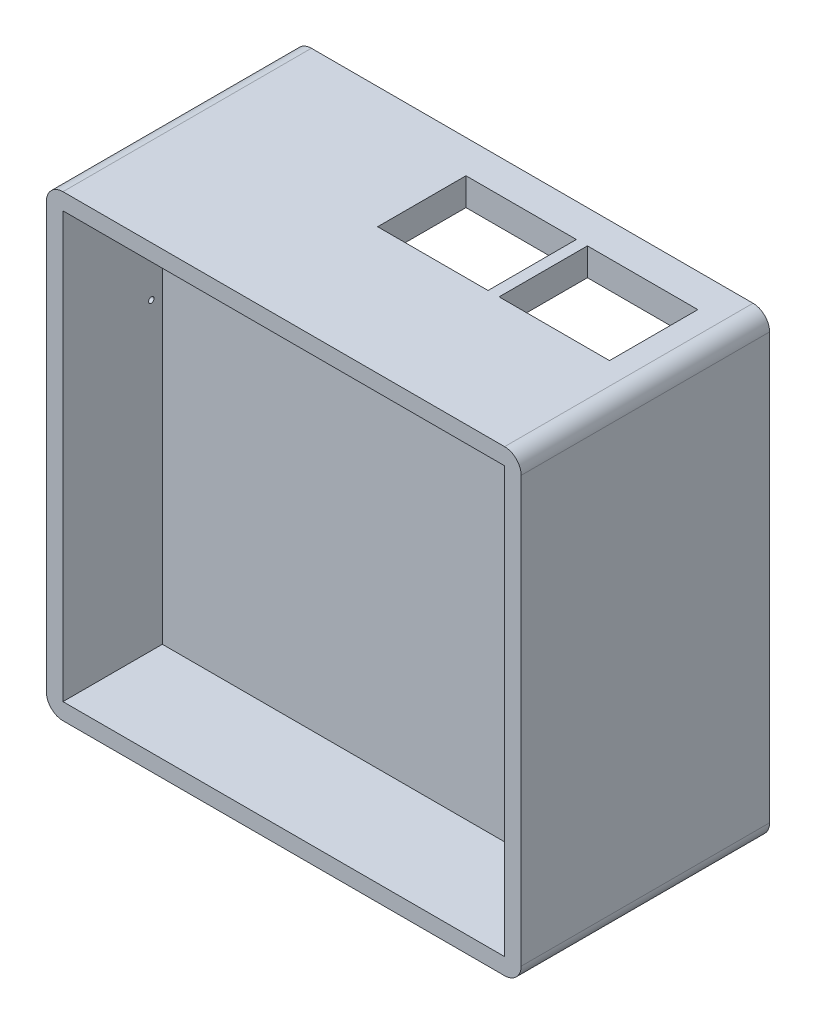
ISO-10303-21;
HEADER;
FILE_DESCRIPTION(('STEP AP214'),'2;1');
FILE_NAME('part.step','',(''),(''),'','','');
FILE_SCHEMA(('AUTOMOTIVE_DESIGN { 1 0 10303 214 1 1 1 1 }'));
ENDSEC;
DATA;
#1=APPLICATION_CONTEXT('core data for automotive mechanical design processes');
#2=APPLICATION_PROTOCOL_DEFINITION('international standard','automotive_design',2000,#1);
#3=PRODUCT_CONTEXT('',#1,'mechanical');
#4=PRODUCT('Part','Part','',(#3));
#5=PRODUCT_RELATED_PRODUCT_CATEGORY('part','',(#4));
#6=PRODUCT_DEFINITION_FORMATION('','',#4);
#7=PRODUCT_DEFINITION_CONTEXT('part definition',#1,'design');
#8=PRODUCT_DEFINITION('design','',#6,#7);
#9=PRODUCT_DEFINITION_SHAPE('','',#8);
#10=(LENGTH_UNIT() NAMED_UNIT(*) SI_UNIT(.MILLI.,.METRE.));
#11=(NAMED_UNIT(*) PLANE_ANGLE_UNIT() SI_UNIT($,.RADIAN.));
#12=(NAMED_UNIT(*) SI_UNIT($,.STERADIAN.) SOLID_ANGLE_UNIT());
#13=UNCERTAINTY_MEASURE_WITH_UNIT(LENGTH_MEASURE(1.E-05),#10,'distance_accuracy_value','');
#14=(GEOMETRIC_REPRESENTATION_CONTEXT(3) GLOBAL_UNCERTAINTY_ASSIGNED_CONTEXT((#13)) GLOBAL_UNIT_ASSIGNED_CONTEXT((#10,
#11,#12)) REPRESENTATION_CONTEXT('',''));
#15=CARTESIAN_POINT('',(0.,0.,0.));
#16=DIRECTION('',(0.,0.,1.));
#17=DIRECTION('',(1.,0.,0.));
#18=AXIS2_PLACEMENT_3D('',#15,#16,#17);
#19=CARTESIAN_POINT('',(-40.0742268041237,28.9917525773196,45.));
#20=DIRECTION('',(1.,0.,0.));
#21=DIRECTION('',(0.,1.,0.));
#22=AXIS2_PLACEMENT_3D('',#19,#20,#21);
#23=PLANE('',#22);
#24=CARTESIAN_POINT('',(-40.0742268041237,3.99175257731957,29.));
#25=DIRECTION('',(-1.,0.,0.));
#26=DIRECTION('',(0.,-1.,0.));
#27=AXIS2_PLACEMENT_3D('',#24,#25,#26);
#28=CIRCLE('',#27,0.499999999999999);
#29=CARTESIAN_POINT('',(-40.0742268041237,3.49175257731958,29.));
#30=VERTEX_POINT('',#29);
#31=EDGE_CURVE('E468',#30,#30,#28,.T.);
#32=ORIENTED_EDGE('',*,*,#31,.F.);
#33=EDGE_LOOP('',(#32));
#34=FACE_BOUND('',#33,.T.);
#35=DIRECTION('',(0.,0.,1.));
#36=VECTOR('',#35,1.);
#37=CARTESIAN_POINT('',(-40.0742268041237,-1.00824742268043,12.));
#38=LINE('',#37,#36);
#39=CARTESIAN_POINT('',(-40.0742268041237,-1.00824742268043,12.));
#40=VERTEX_POINT('',#39);
#41=CARTESIAN_POINT('',(-40.0742268041237,-1.00824742268043,22.));
#42=VERTEX_POINT('',#41);
#43=EDGE_CURVE('E257',#40,#42,#38,.T.);
#44=ORIENTED_EDGE('',*,*,#43,.F.);
#45=DIRECTION('',(0.,-1.,0.));
#46=VECTOR('',#45,1.);
#47=CARTESIAN_POINT('',(-40.0742268041237,-1.00824742268043,12.));
#48=LINE('',#47,#46);
#49=CARTESIAN_POINT('',(-40.0742268041237,23.9917525773196,12.));
#50=VERTEX_POINT('',#49);
#51=EDGE_CURVE('E262',#50,#40,#48,.T.);
#52=ORIENTED_EDGE('',*,*,#51,.F.);
#53=DIRECTION('',(0.,0.,-1.));
#54=VECTOR('',#53,1.);
#55=CARTESIAN_POINT('',(-40.0742268041237,23.9917525773196,12.));
#56=LINE('',#55,#54);
#57=CARTESIAN_POINT('',(-40.0742268041237,23.9917525773196,22.));
#58=VERTEX_POINT('',#57);
#59=EDGE_CURVE('E266',#58,#50,#56,.T.);
#60=ORIENTED_EDGE('',*,*,#59,.F.);
#61=DIRECTION('',(0.,1.,0.));
#62=VECTOR('',#61,1.);
#63=CARTESIAN_POINT('',(-40.0742268041237,-1.00824742268043,22.));
#64=LINE('',#63,#62);
#65=EDGE_CURVE('E246',#42,#58,#64,.T.);
#66=ORIENTED_EDGE('',*,*,#65,.F.);
#67=EDGE_LOOP('',(#44,#52,#60,#66));
#68=FACE_BOUND('',#67,.T.);
#69=DIRECTION('',(0.,-1.,0.));
#70=VECTOR('',#69,1.);
#71=CARTESIAN_POINT('',(-40.0742268041237,28.9917525773196,0.));
#72=LINE('',#71,#70);
#73=CARTESIAN_POINT('',(-40.0742268041237,25.9917525773196,0.));
#74=VERTEX_POINT('',#73);
#75=CARTESIAN_POINT('',(-40.0742268041237,-51.0082474226804,0.));
#76=VERTEX_POINT('',#75);
#77=EDGE_CURVE('E407',#74,#76,#72,.T.);
#78=ORIENTED_EDGE('',*,*,#77,.T.);
#79=DIRECTION('',(0.,0.,-1.));
#80=VECTOR('',#79,1.);
#81=CARTESIAN_POINT('',(-40.0742268041237,-51.0082474226804,45.));
#82=LINE('',#81,#80);
#83=CARTESIAN_POINT('',(-40.0742268041237,-51.0082474226804,45.));
#84=VERTEX_POINT('',#83);
#85=EDGE_CURVE('E496',#76,#84,#82,.F.);
#86=ORIENTED_EDGE('',*,*,#85,.T.);
#87=DIRECTION('',(0.,-1.,0.));
#88=VECTOR('',#87,1.);
#89=CARTESIAN_POINT('',(-40.0742268041237,28.9917525773196,45.));
#90=LINE('',#89,#88);
#91=CARTESIAN_POINT('',(-40.0742268041237,25.9917525773196,45.));
#92=VERTEX_POINT('',#91);
#93=EDGE_CURVE('E414',#92,#84,#90,.T.);
#94=ORIENTED_EDGE('',*,*,#93,.F.);
#95=DIRECTION('',(0.,0.,-1.));
#96=VECTOR('',#95,1.);
#97=CARTESIAN_POINT('',(-40.0742268041237,25.9917525773196,45.));
#98=LINE('',#97,#96);
#99=EDGE_CURVE('E493',#92,#74,#98,.T.);
#100=ORIENTED_EDGE('',*,*,#99,.T.);
#101=EDGE_LOOP('',(#78,#86,#94,#100));
#102=FACE_BOUND('',#101,.T.);
#103=ADVANCED_FACE('F33',(#34,#68,#102),#23,.F.);
#104=CARTESIAN_POINT('',(-40.0742268041237,-54.0082474226804,45.));
#105=DIRECTION('',(0.,1.,0.));
#106=DIRECTION('',(0.,0.,1.));
#107=AXIS2_PLACEMENT_3D('',#104,#105,#106);
#108=PLANE('',#107);
#109=DIRECTION('',(1.,0.,0.));
#110=VECTOR('',#109,1.);
#111=CARTESIAN_POINT('',(-40.0742268041237,-54.0082474226804,0.));
#112=LINE('',#111,#110);
#113=CARTESIAN_POINT('',(-37.0742268041237,-54.0082474226804,0.));
#114=VERTEX_POINT('',#113);
#115=CARTESIAN_POINT('',(42.9257731958763,-54.0082474226804,0.));
#116=VERTEX_POINT('',#115);
#117=EDGE_CURVE('E428',#114,#116,#112,.T.);
#118=ORIENTED_EDGE('',*,*,#117,.T.);
#119=DIRECTION('',(0.,0.,-1.));
#120=VECTOR('',#119,1.);
#121=CARTESIAN_POINT('',(42.9257731958763,-54.0082474226804,45.));
#122=LINE('',#121,#120);
#123=CARTESIAN_POINT('',(42.9257731958763,-54.0082474226804,45.));
#124=VERTEX_POINT('',#123);
#125=EDGE_CURVE('E484',#116,#124,#122,.F.);
#126=ORIENTED_EDGE('',*,*,#125,.T.);
#127=DIRECTION('',(1.,0.,0.));
#128=VECTOR('',#127,1.);
#129=CARTESIAN_POINT('',(-40.0742268041237,-54.0082474226804,45.));
#130=LINE('',#129,#128);
#131=CARTESIAN_POINT('',(-37.0742268041237,-54.0082474226804,45.));
#132=VERTEX_POINT('',#131);
#133=EDGE_CURVE('E417',#132,#124,#130,.T.);
#134=ORIENTED_EDGE('',*,*,#133,.F.);
#135=DIRECTION('',(0.,0.,-1.));
#136=VECTOR('',#135,1.);
#137=CARTESIAN_POINT('',(-37.0742268041237,-54.0082474226804,45.));
#138=LINE('',#137,#136);
#139=EDGE_CURVE('E481',#132,#114,#138,.T.);
#140=ORIENTED_EDGE('',*,*,#139,.T.);
#141=EDGE_LOOP('',(#118,#126,#134,#140));
#142=FACE_BOUND('',#141,.T.);
#143=ADVANCED_FACE('F520',(#142),#108,.F.);
#144=CARTESIAN_POINT('',(45.9257731958763,28.9917525773196,45.));
#145=DIRECTION('',(-1.,0.,0.));
#146=DIRECTION('',(0.,-1.,0.));
#147=AXIS2_PLACEMENT_3D('',#144,#145,#146);
#148=PLANE('',#147);
#149=DIRECTION('',(0.,1.,0.));
#150=VECTOR('',#149,1.);
#151=CARTESIAN_POINT('',(45.9257731958763,28.9917525773196,45.));
#152=LINE('',#151,#150);
#153=CARTESIAN_POINT('',(45.9257731958763,-51.0082474226804,45.));
#154=VERTEX_POINT('',#153);
#155=CARTESIAN_POINT('',(45.9257731958763,25.9917525773196,45.));
#156=VERTEX_POINT('',#155);
#157=EDGE_CURVE('E421',#154,#156,#152,.T.);
#158=ORIENTED_EDGE('',*,*,#157,.F.);
#159=DIRECTION('',(0.,0.,-1.));
#160=VECTOR('',#159,1.);
#161=CARTESIAN_POINT('',(45.9257731958763,-51.0082474226804,45.));
#162=LINE('',#161,#160);
#163=CARTESIAN_POINT('',(45.9257731958763,-51.0082474226804,0.));
#164=VERTEX_POINT('',#163);
#165=EDGE_CURVE('E470',#154,#164,#162,.T.);
#166=ORIENTED_EDGE('',*,*,#165,.T.);
#167=DIRECTION('',(0.,1.,0.));
#168=VECTOR('',#167,1.);
#169=CARTESIAN_POINT('',(45.9257731958763,28.9917525773196,0.));
#170=LINE('',#169,#168);
#171=CARTESIAN_POINT('',(45.9257731958763,25.9917525773196,0.));
#172=VERTEX_POINT('',#171);
#173=EDGE_CURVE('E431',#164,#172,#170,.T.);
#174=ORIENTED_EDGE('',*,*,#173,.T.);
#175=DIRECTION('',(0.,0.,-1.));
#176=VECTOR('',#175,1.);
#177=CARTESIAN_POINT('',(45.9257731958763,25.9917525773196,45.));
#178=LINE('',#177,#176);
#179=EDGE_CURVE('E464',#172,#156,#178,.F.);
#180=ORIENTED_EDGE('',*,*,#179,.T.);
#181=EDGE_LOOP('',(#158,#166,#174,#180));
#182=FACE_BOUND('',#181,.T.);
#183=ADVANCED_FACE('F528',(#182),#148,.F.);
#184=CARTESIAN_POINT('',(-40.0742268041237,28.9917525773196,45.));
#185=DIRECTION('',(0.,-1.,0.));
#186=DIRECTION('',(0.,0.,-1.));
#187=AXIS2_PLACEMENT_3D('',#184,#185,#186);
#188=PLANE('',#187);
#189=DIRECTION('',(-1.,0.,0.));
#190=VECTOR('',#189,1.);
#191=CARTESIAN_POINT('',(16.9257731958763,28.9917525773196,6.));
#192=LINE('',#191,#190);
#193=CARTESIAN_POINT('',(16.9257731958763,28.9917525773196,6.));
#194=VERTEX_POINT('',#193);
#195=CARTESIAN_POINT('',(-3.07422680412372,28.9917525773196,6.));
#196=VERTEX_POINT('',#195);
#197=EDGE_CURVE('E277',#194,#196,#192,.T.);
#198=ORIENTED_EDGE('',*,*,#197,.F.);
#199=DIRECTION('',(0.,0.,-1.));
#200=VECTOR('',#199,1.);
#201=CARTESIAN_POINT('',(16.9257731958763,28.9917525773196,6.));
#202=LINE('',#201,#200);
#203=CARTESIAN_POINT('',(16.9257731958763,28.9917525773196,22.));
#204=VERTEX_POINT('',#203);
#205=EDGE_CURVE('E273',#204,#194,#202,.T.);
#206=ORIENTED_EDGE('',*,*,#205,.F.);
#207=DIRECTION('',(1.,0.,0.));
#208=VECTOR('',#207,1.);
#209=CARTESIAN_POINT('',(16.9257731958763,28.9917525773196,22.));
#210=LINE('',#209,#208);
#211=CARTESIAN_POINT('',(-3.07422680412372,28.9917525773196,22.));
#212=VERTEX_POINT('',#211);
#213=EDGE_CURVE('E283',#212,#204,#210,.T.);
#214=ORIENTED_EDGE('',*,*,#213,.F.);
#215=DIRECTION('',(0.,0.,1.));
#216=VECTOR('',#215,1.);
#217=CARTESIAN_POINT('',(-3.07422680412372,28.9917525773196,6.));
#218=LINE('',#217,#216);
#219=EDGE_CURVE('E280',#196,#212,#218,.T.);
#220=ORIENTED_EDGE('',*,*,#219,.F.);
#221=EDGE_LOOP('',(#198,#206,#214,#220));
#222=FACE_BOUND('',#221,.T.);
#223=DIRECTION('',(-1.,0.,0.));
#224=VECTOR('',#223,1.);
#225=CARTESIAN_POINT('',(38.9257731958763,28.9917525773196,6.));
#226=LINE('',#225,#224);
#227=CARTESIAN_POINT('',(38.9257731958763,28.9917525773196,6.));
#228=VERTEX_POINT('',#227);
#229=CARTESIAN_POINT('',(18.9257731958763,28.9917525773196,6.));
#230=VERTEX_POINT('',#229);
#231=EDGE_CURVE('E297',#228,#230,#226,.T.);
#232=ORIENTED_EDGE('',*,*,#231,.F.);
#233=DIRECTION('',(0.,0.,-1.));
#234=VECTOR('',#233,1.);
#235=CARTESIAN_POINT('',(38.9257731958763,28.9917525773196,6.));
#236=LINE('',#235,#234);
#237=CARTESIAN_POINT('',(38.9257731958763,28.9917525773196,22.));
#238=VERTEX_POINT('',#237);
#239=EDGE_CURVE('E289',#238,#228,#236,.T.);
#240=ORIENTED_EDGE('',*,*,#239,.F.);
#241=DIRECTION('',(1.,0.,0.));
#242=VECTOR('',#241,1.);
#243=CARTESIAN_POINT('',(38.9257731958763,28.9917525773196,22.));
#244=LINE('',#243,#242);
#245=CARTESIAN_POINT('',(18.9257731958763,28.9917525773196,22.));
#246=VERTEX_POINT('',#245);
#247=EDGE_CURVE('E303',#246,#238,#244,.T.);
#248=ORIENTED_EDGE('',*,*,#247,.F.);
#249=DIRECTION('',(0.,0.,1.));
#250=VECTOR('',#249,1.);
#251=CARTESIAN_POINT('',(18.9257731958763,28.9917525773196,6.));
#252=LINE('',#251,#250);
#253=EDGE_CURVE('E300',#230,#246,#252,.T.);
#254=ORIENTED_EDGE('',*,*,#253,.F.);
#255=EDGE_LOOP('',(#232,#240,#248,#254));
#256=FACE_BOUND('',#255,.T.);
#257=DIRECTION('',(-1.,0.,0.));
#258=VECTOR('',#257,1.);
#259=CARTESIAN_POINT('',(-40.0742268041237,28.9917525773196,0.));
#260=LINE('',#259,#258);
#261=CARTESIAN_POINT('',(42.9257731958763,28.9917525773196,0.));
#262=VERTEX_POINT('',#261);
#263=CARTESIAN_POINT('',(-37.0742268041237,28.9917525773196,0.));
#264=VERTEX_POINT('',#263);
#265=EDGE_CURVE('E418',#262,#264,#260,.T.);
#266=ORIENTED_EDGE('',*,*,#265,.T.);
#267=DIRECTION('',(0.,0.,-1.));
#268=VECTOR('',#267,1.);
#269=CARTESIAN_POINT('',(-37.0742268041237,28.9917525773196,45.));
#270=LINE('',#269,#268);
#271=CARTESIAN_POINT('',(-37.0742268041237,28.9917525773196,45.));
#272=VERTEX_POINT('',#271);
#273=EDGE_CURVE('E11',#264,#272,#270,.F.);
#274=ORIENTED_EDGE('',*,*,#273,.T.);
#275=DIRECTION('',(-1.,0.,0.));
#276=VECTOR('',#275,1.);
#277=CARTESIAN_POINT('',(-40.0742268041237,28.9917525773196,45.));
#278=LINE('',#277,#276);
#279=CARTESIAN_POINT('',(42.9257731958763,28.9917525773196,45.));
#280=VERTEX_POINT('',#279);
#281=EDGE_CURVE('E423',#280,#272,#278,.T.);
#282=ORIENTED_EDGE('',*,*,#281,.F.);
#283=DIRECTION('',(0.,0.,-1.));
#284=VECTOR('',#283,1.);
#285=CARTESIAN_POINT('',(42.9257731958763,28.9917525773196,45.));
#286=LINE('',#285,#284);
#287=EDGE_CURVE('E41',#280,#262,#286,.T.);
#288=ORIENTED_EDGE('',*,*,#287,.T.);
#289=EDGE_LOOP('',(#266,#274,#282,#288));
#290=FACE_BOUND('',#289,.T.);
#291=ADVANCED_FACE('F500',(#222,#256,#290),#188,.F.);
#292=CARTESIAN_POINT('',(0.,0.,45.));
#293=DIRECTION('',(0.,0.,1.));
#294=DIRECTION('',(1.,0.,0.));
#295=AXIS2_PLACEMENT_3D('',#292,#293,#294);
#296=PLANE('',#295);
#297=DIRECTION('',(0.,-1.,0.));
#298=VECTOR('',#297,1.);
#299=CARTESIAN_POINT('',(-37.0742268041237,25.9917525773196,45.));
#300=LINE('',#299,#298);
#301=CARTESIAN_POINT('',(-37.0742268041237,25.9917525773196,45.));
#302=VERTEX_POINT('',#301);
#303=CARTESIAN_POINT('',(-37.0742268041237,-51.0082474226804,45.));
#304=VERTEX_POINT('',#303);
#305=EDGE_CURVE('E309',#302,#304,#300,.T.);
#306=ORIENTED_EDGE('',*,*,#305,.F.);
#307=DIRECTION('',(-1.,0.,0.));
#308=VECTOR('',#307,1.);
#309=CARTESIAN_POINT('',(-37.0742268041237,25.9917525773196,45.));
#310=LINE('',#309,#308);
#311=CARTESIAN_POINT('',(42.9257731958763,25.9917525773196,45.));
#312=VERTEX_POINT('',#311);
#313=EDGE_CURVE('E320',#312,#302,#310,.T.);
#314=ORIENTED_EDGE('',*,*,#313,.F.);
#315=DIRECTION('',(0.,1.,0.));
#316=VECTOR('',#315,1.);
#317=CARTESIAN_POINT('',(42.9257731958763,25.9917525773196,45.));
#318=LINE('',#317,#316);
#319=CARTESIAN_POINT('',(42.9257731958763,-51.0082474226804,45.));
#320=VERTEX_POINT('',#319);
#321=EDGE_CURVE('E334',#320,#312,#318,.T.);
#322=ORIENTED_EDGE('',*,*,#321,.F.);
#323=DIRECTION('',(1.,0.,0.));
#324=VECTOR('',#323,1.);
#325=CARTESIAN_POINT('',(-37.0742268041237,-51.0082474226804,45.));
#326=LINE('',#325,#324);
#327=EDGE_CURVE('E331',#304,#320,#326,.T.);
#328=ORIENTED_EDGE('',*,*,#327,.F.);
#329=EDGE_LOOP('',(#306,#314,#322,#328));
#330=FACE_BOUND('',#329,.T.);
#331=ORIENTED_EDGE('',*,*,#133,.T.);
#332=CARTESIAN_POINT('',(42.9257731958763,-51.0082474226804,45.));
#333=DIRECTION('',(0.,0.,1.));
#334=DIRECTION('',(1.,0.,0.));
#335=AXIS2_PLACEMENT_3D('',#332,#333,#334);
#336=CIRCLE('',#335,3.);
#337=EDGE_CURVE('E491',#124,#154,#336,.T.);
#338=ORIENTED_EDGE('',*,*,#337,.T.);
#339=ORIENTED_EDGE('',*,*,#157,.T.);
#340=CARTESIAN_POINT('',(42.9257731958763,25.9917525773196,45.));
#341=DIRECTION('',(0.,0.,1.));
#342=DIRECTION('',(1.,0.,0.));
#343=AXIS2_PLACEMENT_3D('',#340,#341,#342);
#344=CIRCLE('',#343,3.);
#345=EDGE_CURVE('E53',#156,#280,#344,.T.);
#346=ORIENTED_EDGE('',*,*,#345,.T.);
#347=ORIENTED_EDGE('',*,*,#281,.T.);
#348=CARTESIAN_POINT('',(-37.0742268041237,25.9917525773196,45.));
#349=DIRECTION('',(0.,0.,1.));
#350=DIRECTION('',(1.,0.,0.));
#351=AXIS2_PLACEMENT_3D('',#348,#349,#350);
#352=CIRCLE('',#351,3.);
#353=EDGE_CURVE('E487',#272,#92,#352,.T.);
#354=ORIENTED_EDGE('',*,*,#353,.T.);
#355=ORIENTED_EDGE('',*,*,#93,.T.);
#356=CARTESIAN_POINT('',(-37.0742268041237,-51.0082474226804,45.));
#357=DIRECTION('',(0.,0.,1.));
#358=DIRECTION('',(1.,0.,0.));
#359=AXIS2_PLACEMENT_3D('',#356,#357,#358);
#360=CIRCLE('',#359,3.);
#361=EDGE_CURVE('E489',#84,#132,#360,.T.);
#362=ORIENTED_EDGE('',*,*,#361,.T.);
#363=EDGE_LOOP('',(#331,#338,#339,#346,#347,#354,#355,#362));
#364=FACE_BOUND('',#363,.T.);
#365=ADVANCED_FACE('F513',(#330,#364),#296,.T.);
#366=CARTESIAN_POINT('',(0.,0.,0.));
#367=DIRECTION('',(0.,0.,1.));
#368=DIRECTION('',(1.,0.,0.));
#369=AXIS2_PLACEMENT_3D('',#366,#367,#368);
#370=PLANE('',#369);
#371=DIRECTION('',(-1.,0.,0.));
#372=VECTOR('',#371,1.);
#373=CARTESIAN_POINT('',(43.9257731958763,-52.0082474226804,0.));
#374=LINE('',#373,#372);
#375=CARTESIAN_POINT('',(43.9257731958763,-52.0082474226804,0.));
#376=VERTEX_POINT('',#375);
#377=CARTESIAN_POINT('',(-38.0742268041237,-52.0082474226804,0.));
#378=VERTEX_POINT('',#377);
#379=EDGE_CURVE('E397',#376,#378,#374,.T.);
#380=ORIENTED_EDGE('',*,*,#379,.F.);
#381=DIRECTION('',(0.,-1.,0.));
#382=VECTOR('',#381,1.);
#383=CARTESIAN_POINT('',(43.9257731958763,26.9917525773196,0.));
#384=LINE('',#383,#382);
#385=CARTESIAN_POINT('',(43.9257731958763,26.9917525773196,0.));
#386=VERTEX_POINT('',#385);
#387=EDGE_CURVE('E374',#386,#376,#384,.T.);
#388=ORIENTED_EDGE('',*,*,#387,.F.);
#389=DIRECTION('',(1.,0.,0.));
#390=VECTOR('',#389,1.);
#391=CARTESIAN_POINT('',(43.9257731958763,26.9917525773196,0.));
#392=LINE('',#391,#390);
#393=CARTESIAN_POINT('',(-38.0742268041237,26.9917525773196,0.));
#394=VERTEX_POINT('',#393);
#395=EDGE_CURVE('E386',#394,#386,#392,.T.);
#396=ORIENTED_EDGE('',*,*,#395,.F.);
#397=DIRECTION('',(0.,1.,0.));
#398=VECTOR('',#397,1.);
#399=CARTESIAN_POINT('',(-38.0742268041237,26.9917525773196,0.));
#400=LINE('',#399,#398);
#401=EDGE_CURVE('E400',#378,#394,#400,.T.);
#402=ORIENTED_EDGE('',*,*,#401,.F.);
#403=EDGE_LOOP('',(#380,#388,#396,#402));
#404=FACE_BOUND('',#403,.T.);
#405=ORIENTED_EDGE('',*,*,#173,.F.);
#406=CARTESIAN_POINT('',(42.9257731958763,-51.0082474226804,0.));
#407=DIRECTION('',(0.,0.,1.));
#408=DIRECTION('',(1.,0.,0.));
#409=AXIS2_PLACEMENT_3D('',#406,#407,#408);
#410=CIRCLE('',#409,3.);
#411=EDGE_CURVE('E479',#164,#116,#410,.F.);
#412=ORIENTED_EDGE('',*,*,#411,.T.);
#413=ORIENTED_EDGE('',*,*,#117,.F.);
#414=CARTESIAN_POINT('',(-37.0742268041237,-51.0082474226804,0.));
#415=DIRECTION('',(0.,0.,1.));
#416=DIRECTION('',(1.,0.,0.));
#417=AXIS2_PLACEMENT_3D('',#414,#415,#416);
#418=CIRCLE('',#417,3.);
#419=EDGE_CURVE('E477',#114,#76,#418,.F.);
#420=ORIENTED_EDGE('',*,*,#419,.T.);
#421=ORIENTED_EDGE('',*,*,#77,.F.);
#422=CARTESIAN_POINT('',(-37.0742268041237,25.9917525773196,0.));
#423=DIRECTION('',(0.,0.,1.));
#424=DIRECTION('',(1.,0.,0.));
#425=AXIS2_PLACEMENT_3D('',#422,#423,#424);
#426=CIRCLE('',#425,3.);
#427=EDGE_CURVE('E475',#74,#264,#426,.F.);
#428=ORIENTED_EDGE('',*,*,#427,.T.);
#429=ORIENTED_EDGE('',*,*,#265,.F.);
#430=CARTESIAN_POINT('',(42.9257731958763,25.9917525773196,0.));
#431=DIRECTION('',(0.,0.,1.));
#432=DIRECTION('',(1.,0.,0.));
#433=AXIS2_PLACEMENT_3D('',#430,#431,#432);
#434=CIRCLE('',#433,3.);
#435=EDGE_CURVE('E473',#262,#172,#434,.F.);
#436=ORIENTED_EDGE('',*,*,#435,.T.);
#437=EDGE_LOOP('',(#405,#412,#413,#420,#421,#428,#429,#436));
#438=FACE_BOUND('',#437,.T.);
#439=ADVANCED_FACE('F504',(#404,#438),#370,.F.);
#440=CARTESIAN_POINT('',(43.9257731958763,26.9917525773196,3.));
#441=DIRECTION('',(1.,0.,0.));
#442=DIRECTION('',(0.,1.,0.));
#443=AXIS2_PLACEMENT_3D('',#440,#441,#442);
#444=PLANE('',#443);
#445=ORIENTED_EDGE('',*,*,#387,.T.);
#446=DIRECTION('',(0.,0.,-1.));
#447=VECTOR('',#446,1.);
#448=CARTESIAN_POINT('',(43.9257731958763,-52.0082474226804,3.));
#449=LINE('',#448,#447);
#450=CARTESIAN_POINT('',(43.9257731958763,-52.0082474226804,3.));
#451=VERTEX_POINT('',#450);
#452=EDGE_CURVE('E395',#451,#376,#449,.T.);
#453=ORIENTED_EDGE('',*,*,#452,.F.);
#454=DIRECTION('',(0.,-1.,0.));
#455=VECTOR('',#454,1.);
#456=CARTESIAN_POINT('',(43.9257731958763,26.9917525773196,3.));
#457=LINE('',#456,#455);
#458=CARTESIAN_POINT('',(43.9257731958763,26.9917525773196,3.));
#459=VERTEX_POINT('',#458);
#460=EDGE_CURVE('E382',#459,#451,#457,.T.);
#461=ORIENTED_EDGE('',*,*,#460,.F.);
#462=DIRECTION('',(0.,0.,-1.));
#463=VECTOR('',#462,1.);
#464=CARTESIAN_POINT('',(43.9257731958763,26.9917525773196,3.));
#465=LINE('',#464,#463);
#466=EDGE_CURVE('E405',#459,#386,#465,.T.);
#467=ORIENTED_EDGE('',*,*,#466,.T.);
#468=EDGE_LOOP('',(#445,#453,#461,#467));
#469=FACE_BOUND('',#468,.T.);
#470=ADVANCED_FACE('F816',(#469),#444,.F.);
#471=CARTESIAN_POINT('',(43.9257731958763,26.9917525773196,3.));
#472=DIRECTION('',(0.,1.,0.));
#473=DIRECTION('',(0.,0.,1.));
#474=AXIS2_PLACEMENT_3D('',#471,#472,#473);
#475=PLANE('',#474);
#476=ORIENTED_EDGE('',*,*,#395,.T.);
#477=ORIENTED_EDGE('',*,*,#466,.F.);
#478=DIRECTION('',(1.,0.,0.));
#479=VECTOR('',#478,1.);
#480=CARTESIAN_POINT('',(43.9257731958763,26.9917525773196,3.));
#481=LINE('',#480,#479);
#482=CARTESIAN_POINT('',(-38.0742268041237,26.9917525773196,3.));
#483=VERTEX_POINT('',#482);
#484=EDGE_CURVE('E392',#483,#459,#481,.T.);
#485=ORIENTED_EDGE('',*,*,#484,.F.);
#486=DIRECTION('',(0.,0.,-1.));
#487=VECTOR('',#486,1.);
#488=CARTESIAN_POINT('',(-38.0742268041237,26.9917525773196,3.));
#489=LINE('',#488,#487);
#490=EDGE_CURVE('E408',#483,#394,#489,.T.);
#491=ORIENTED_EDGE('',*,*,#490,.T.);
#492=EDGE_LOOP('',(#476,#477,#485,#491));
#493=FACE_BOUND('',#492,.T.);
#494=ADVANCED_FACE('F808',(#493),#475,.F.);
#495=CARTESIAN_POINT('',(-38.0742268041237,26.9917525773196,3.));
#496=DIRECTION('',(-1.,0.,0.));
#497=DIRECTION('',(0.,-1.,0.));
#498=AXIS2_PLACEMENT_3D('',#495,#496,#497);
#499=PLANE('',#498);
#500=ORIENTED_EDGE('',*,*,#401,.T.);
#501=ORIENTED_EDGE('',*,*,#490,.F.);
#502=DIRECTION('',(0.,1.,0.));
#503=VECTOR('',#502,1.);
#504=CARTESIAN_POINT('',(-38.0742268041237,26.9917525773196,3.));
#505=LINE('',#504,#503);
#506=CARTESIAN_POINT('',(-38.0742268041237,-52.0082474226804,3.));
#507=VERTEX_POINT('',#506);
#508=EDGE_CURVE('E389',#507,#483,#505,.T.);
#509=ORIENTED_EDGE('',*,*,#508,.F.);
#510=DIRECTION('',(0.,0.,-1.));
#511=VECTOR('',#510,1.);
#512=CARTESIAN_POINT('',(-38.0742268041237,-52.0082474226804,3.));
#513=LINE('',#512,#511);
#514=EDGE_CURVE('E410',#507,#378,#513,.T.);
#515=ORIENTED_EDGE('',*,*,#514,.T.);
#516=EDGE_LOOP('',(#500,#501,#509,#515));
#517=FACE_BOUND('',#516,.T.);
#518=ADVANCED_FACE('F800',(#517),#499,.F.);
#519=CARTESIAN_POINT('',(43.9257731958763,-52.0082474226804,3.));
#520=DIRECTION('',(0.,-1.,0.));
#521=DIRECTION('',(0.,0.,-1.));
#522=AXIS2_PLACEMENT_3D('',#519,#520,#521);
#523=PLANE('',#522);
#524=ORIENTED_EDGE('',*,*,#379,.T.);
#525=ORIENTED_EDGE('',*,*,#514,.F.);
#526=DIRECTION('',(-1.,0.,0.));
#527=VECTOR('',#526,1.);
#528=CARTESIAN_POINT('',(43.9257731958763,-52.0082474226804,3.));
#529=LINE('',#528,#527);
#530=EDGE_CURVE('E385',#451,#507,#529,.T.);
#531=ORIENTED_EDGE('',*,*,#530,.F.);
#532=ORIENTED_EDGE('',*,*,#452,.T.);
#533=EDGE_LOOP('',(#524,#525,#531,#532));
#534=FACE_BOUND('',#533,.T.);
#535=ADVANCED_FACE('F792',(#534),#523,.F.);
#536=CARTESIAN_POINT('',(0.,0.,3.));
#537=DIRECTION('',(0.,0.,-1.));
#538=DIRECTION('',(-1.,0.,0.));
#539=AXIS2_PLACEMENT_3D('',#536,#537,#538);
#540=PLANE('',#539);
#541=DIRECTION('',(0.,-1.,0.));
#542=VECTOR('',#541,1.);
#543=CARTESIAN_POINT('',(40.9257731958763,23.9917525773196,3.));
#544=LINE('',#543,#542);
#545=CARTESIAN_POINT('',(40.9257731958763,23.9917525773196,3.));
#546=VERTEX_POINT('',#545);
#547=CARTESIAN_POINT('',(40.9257731958763,-49.0082474226804,3.));
#548=VERTEX_POINT('',#547);
#549=EDGE_CURVE('E341',#546,#548,#544,.T.);
#550=ORIENTED_EDGE('',*,*,#549,.F.);
#551=DIRECTION('',(1.,0.,0.));
#552=VECTOR('',#551,1.);
#553=CARTESIAN_POINT('',(40.9257731958763,23.9917525773196,3.));
#554=LINE('',#553,#552);
#555=CARTESIAN_POINT('',(-35.0742268041237,23.9917525773196,3.));
#556=VERTEX_POINT('',#555);
#557=EDGE_CURVE('E352',#556,#546,#554,.T.);
#558=ORIENTED_EDGE('',*,*,#557,.F.);
#559=DIRECTION('',(0.,1.,0.));
#560=VECTOR('',#559,1.);
#561=CARTESIAN_POINT('',(-35.0742268041237,23.9917525773196,3.));
#562=LINE('',#561,#560);
#563=CARTESIAN_POINT('',(-35.0742268041237,-49.0082474226804,3.));
#564=VERTEX_POINT('',#563);
#565=EDGE_CURVE('E367',#564,#556,#562,.T.);
#566=ORIENTED_EDGE('',*,*,#565,.F.);
#567=DIRECTION('',(-1.,0.,0.));
#568=VECTOR('',#567,1.);
#569=CARTESIAN_POINT('',(40.9257731958763,-49.0082474226804,3.));
#570=LINE('',#569,#568);
#571=EDGE_CURVE('E364',#548,#564,#570,.T.);
#572=ORIENTED_EDGE('',*,*,#571,.F.);
#573=EDGE_LOOP('',(#550,#558,#566,#572));
#574=FACE_BOUND('',#573,.T.);
#575=ORIENTED_EDGE('',*,*,#460,.T.);
#576=ORIENTED_EDGE('',*,*,#530,.T.);
#577=ORIENTED_EDGE('',*,*,#508,.T.);
#578=ORIENTED_EDGE('',*,*,#484,.T.);
#579=EDGE_LOOP('',(#575,#576,#577,#578));
#580=FACE_BOUND('',#579,.T.);
#581=ADVANCED_FACE('F785',(#574,#580),#540,.T.);
#582=CARTESIAN_POINT('',(40.9257731958763,23.9917525773196,23.));
#583=DIRECTION('',(1.,0.,0.));
#584=DIRECTION('',(0.,1.,0.));
#585=AXIS2_PLACEMENT_3D('',#582,#583,#584);
#586=PLANE('',#585);
#587=ORIENTED_EDGE('',*,*,#549,.T.);
#588=DIRECTION('',(0.,0.,-1.));
#589=VECTOR('',#588,1.);
#590=CARTESIAN_POINT('',(40.9257731958763,-49.0082474226804,23.));
#591=LINE('',#590,#589);
#592=CARTESIAN_POINT('',(40.9257731958763,-49.0082474226804,23.));
#593=VERTEX_POINT('',#592);
#594=EDGE_CURVE('E361',#593,#548,#591,.T.);
#595=ORIENTED_EDGE('',*,*,#594,.F.);
#596=DIRECTION('',(0.,-1.,0.));
#597=VECTOR('',#596,1.);
#598=CARTESIAN_POINT('',(40.9257731958763,23.9917525773196,23.));
#599=LINE('',#598,#597);
#600=CARTESIAN_POINT('',(40.9257731958763,23.9917525773196,23.));
#601=VERTEX_POINT('',#600);
#602=EDGE_CURVE('E348',#601,#593,#599,.T.);
#603=ORIENTED_EDGE('',*,*,#602,.F.);
#604=DIRECTION('',(0.,0.,-1.));
#605=VECTOR('',#604,1.);
#606=CARTESIAN_POINT('',(40.9257731958763,23.9917525773196,23.));
#607=LINE('',#606,#605);
#608=EDGE_CURVE('E372',#601,#546,#607,.T.);
#609=ORIENTED_EDGE('',*,*,#608,.T.);
#610=EDGE_LOOP('',(#587,#595,#603,#609));
#611=FACE_BOUND('',#610,.T.);
#612=ADVANCED_FACE('F614',(#611),#586,.F.);
#613=CARTESIAN_POINT('',(40.9257731958763,23.9917525773196,23.));
#614=DIRECTION('',(0.,1.,0.));
#615=DIRECTION('',(0.,0.,1.));
#616=AXIS2_PLACEMENT_3D('',#613,#614,#615);
#617=PLANE('',#616);
#618=DIRECTION('',(-1.,0.,0.));
#619=VECTOR('',#618,1.);
#620=CARTESIAN_POINT('',(-22.0742268041237,23.9917525773196,12.));
#621=LINE('',#620,#619);
#622=CARTESIAN_POINT('',(-35.0742268041237,23.9917525773196,12.));
#623=VERTEX_POINT('',#622);
#624=EDGE_CURVE('E271',#623,#50,#621,.T.);
#625=ORIENTED_EDGE('',*,*,#624,.F.);
#626=DIRECTION('',(0.,0.,-1.));
#627=VECTOR('',#626,1.);
#628=CARTESIAN_POINT('',(-35.0742268041237,23.9917525773196,23.));
#629=LINE('',#628,#627);
#630=EDGE_CURVE('E378',#623,#556,#629,.T.);
#631=ORIENTED_EDGE('',*,*,#630,.T.);
#632=ORIENTED_EDGE('',*,*,#557,.T.);
#633=ORIENTED_EDGE('',*,*,#608,.F.);
#634=DIRECTION('',(1.,0.,0.));
#635=VECTOR('',#634,1.);
#636=CARTESIAN_POINT('',(40.9257731958763,23.9917525773196,23.));
#637=LINE('',#636,#635);
#638=CARTESIAN_POINT('',(-35.0742268041237,23.9917525773196,23.));
#639=VERTEX_POINT('',#638);
#640=EDGE_CURVE('E358',#639,#601,#637,.T.);
#641=ORIENTED_EDGE('',*,*,#640,.F.);
#642=CARTESIAN_POINT('',(-35.0742268041237,23.9917525773196,22.));
#643=VERTEX_POINT('',#642);
#644=EDGE_CURVE('E375',#639,#643,#629,.T.);
#645=ORIENTED_EDGE('',*,*,#644,.T.);
#646=DIRECTION('',(-1.,0.,0.));
#647=VECTOR('',#646,1.);
#648=CARTESIAN_POINT('',(-22.0742268041237,23.9917525773196,22.));
#649=LINE('',#648,#647);
#650=EDGE_CURVE('E252',#643,#58,#649,.T.);
#651=ORIENTED_EDGE('',*,*,#650,.T.);
#652=ORIENTED_EDGE('',*,*,#59,.T.);
#653=EDGE_LOOP('',(#625,#631,#632,#633,#641,#645,#651,#652));
#654=FACE_BOUND('',#653,.T.);
#655=DIRECTION('',(1.,0.,0.));
#656=VECTOR('',#655,1.);
#657=CARTESIAN_POINT('',(40.9257731958763,23.9917525773196,22.));
#658=LINE('',#657,#656);
#659=CARTESIAN_POINT('',(-3.07422680412372,23.9917525773196,22.));
#660=VERTEX_POINT('',#659);
#661=CARTESIAN_POINT('',(16.9257731958763,23.9917525773196,22.));
#662=VERTEX_POINT('',#661);
#663=EDGE_CURVE('E452',#660,#662,#658,.T.);
#664=ORIENTED_EDGE('',*,*,#663,.T.);
#665=DIRECTION('',(0.,0.,-1.));
#666=VECTOR('',#665,1.);
#667=CARTESIAN_POINT('',(16.9257731958763,23.9917525773196,23.));
#668=LINE('',#667,#666);
#669=CARTESIAN_POINT('',(16.9257731958763,23.9917525773196,6.));
#670=VERTEX_POINT('',#669);
#671=EDGE_CURVE('E455',#662,#670,#668,.T.);
#672=ORIENTED_EDGE('',*,*,#671,.T.);
#673=DIRECTION('',(-1.,0.,0.));
#674=VECTOR('',#673,1.);
#675=CARTESIAN_POINT('',(40.9257731958763,23.9917525773196,5.99999999999999));
#676=LINE('',#675,#674);
#677=CARTESIAN_POINT('',(-3.07422680412372,23.9917525773196,6.));
#678=VERTEX_POINT('',#677);
#679=EDGE_CURVE('E446',#670,#678,#676,.T.);
#680=ORIENTED_EDGE('',*,*,#679,.T.);
#681=DIRECTION('',(0.,0.,1.));
#682=VECTOR('',#681,1.);
#683=CARTESIAN_POINT('',(-3.07422680412372,23.9917525773196,23.));
#684=LINE('',#683,#682);
#685=EDGE_CURVE('E449',#678,#660,#684,.T.);
#686=ORIENTED_EDGE('',*,*,#685,.T.);
#687=EDGE_LOOP('',(#664,#672,#680,#686));
#688=FACE_BOUND('',#687,.T.);
#689=DIRECTION('',(1.,0.,0.));
#690=VECTOR('',#689,1.);
#691=CARTESIAN_POINT('',(40.9257731958763,23.9917525773196,22.));
#692=LINE('',#691,#690);
#693=CARTESIAN_POINT('',(18.9257731958763,23.9917525773196,22.));
#694=VERTEX_POINT('',#693);
#695=CARTESIAN_POINT('',(38.9257731958763,23.9917525773196,22.));
#696=VERTEX_POINT('',#695);
#697=EDGE_CURVE('E440',#694,#696,#692,.T.);
#698=ORIENTED_EDGE('',*,*,#697,.T.);
#699=DIRECTION('',(0.,0.,-1.));
#700=VECTOR('',#699,1.);
#701=CARTESIAN_POINT('',(38.9257731958763,23.9917525773196,23.));
#702=LINE('',#701,#700);
#703=CARTESIAN_POINT('',(38.9257731958763,23.9917525773196,6.));
#704=VERTEX_POINT('',#703);
#705=EDGE_CURVE('E443',#696,#704,#702,.T.);
#706=ORIENTED_EDGE('',*,*,#705,.T.);
#707=DIRECTION('',(-1.,0.,0.));
#708=VECTOR('',#707,1.);
#709=CARTESIAN_POINT('',(40.9257731958763,23.9917525773196,6.));
#710=LINE('',#709,#708);
#711=CARTESIAN_POINT('',(18.9257731958763,23.9917525773196,6.));
#712=VERTEX_POINT('',#711);
#713=EDGE_CURVE('E425',#704,#712,#710,.T.);
#714=ORIENTED_EDGE('',*,*,#713,.T.);
#715=DIRECTION('',(0.,0.,1.));
#716=VECTOR('',#715,1.);
#717=CARTESIAN_POINT('',(18.9257731958763,23.9917525773196,23.));
#718=LINE('',#717,#716);
#719=EDGE_CURVE('E437',#712,#694,#718,.T.);
#720=ORIENTED_EDGE('',*,*,#719,.T.);
#721=EDGE_LOOP('',(#698,#706,#714,#720));
#722=FACE_BOUND('',#721,.T.);
#723=ADVANCED_FACE('F606',(#654,#688,#722),#617,.F.);
#724=CARTESIAN_POINT('',(-35.0742268041237,23.9917525773196,23.));
#725=DIRECTION('',(-1.,0.,0.));
#726=DIRECTION('',(0.,0.,1.));
#727=AXIS2_PLACEMENT_3D('',#724,#725,#726);
#728=PLANE('',#727);
#729=ORIENTED_EDGE('',*,*,#630,.F.);
#730=DIRECTION('',(0.,-1.,0.));
#731=VECTOR('',#730,1.);
#732=CARTESIAN_POINT('',(-35.0742268041237,23.9917525773196,12.));
#733=LINE('',#732,#731);
#734=CARTESIAN_POINT('',(-35.0742268041237,-1.00824742268042,12.));
#735=VERTEX_POINT('',#734);
#736=EDGE_CURVE('E461',#623,#735,#733,.T.);
#737=ORIENTED_EDGE('',*,*,#736,.T.);
#738=DIRECTION('',(0.,0.,1.));
#739=VECTOR('',#738,1.);
#740=CARTESIAN_POINT('',(-35.0742268041237,-1.00824742268043,23.));
#741=LINE('',#740,#739);
#742=CARTESIAN_POINT('',(-35.0742268041237,-1.00824742268043,22.));
#743=VERTEX_POINT('',#742);
#744=EDGE_CURVE('E458',#735,#743,#741,.T.);
#745=ORIENTED_EDGE('',*,*,#744,.T.);
#746=DIRECTION('',(0.,1.,0.));
#747=VECTOR('',#746,1.);
#748=CARTESIAN_POINT('',(-35.0742268041237,23.9917525773196,22.));
#749=LINE('',#748,#747);
#750=EDGE_CURVE('E249',#743,#643,#749,.T.);
#751=ORIENTED_EDGE('',*,*,#750,.T.);
#752=ORIENTED_EDGE('',*,*,#644,.F.);
#753=DIRECTION('',(0.,1.,0.));
#754=VECTOR('',#753,1.);
#755=CARTESIAN_POINT('',(-35.0742268041237,23.9917525773196,23.));
#756=LINE('',#755,#754);
#757=CARTESIAN_POINT('',(-35.0742268041237,-49.0082474226804,23.));
#758=VERTEX_POINT('',#757);
#759=EDGE_CURVE('E355',#758,#639,#756,.T.);
#760=ORIENTED_EDGE('',*,*,#759,.F.);
#761=DIRECTION('',(0.,0.,-1.));
#762=VECTOR('',#761,1.);
#763=CARTESIAN_POINT('',(-35.0742268041237,-49.0082474226804,23.));
#764=LINE('',#763,#762);
#765=EDGE_CURVE('E379',#758,#564,#764,.T.);
#766=ORIENTED_EDGE('',*,*,#765,.T.);
#767=ORIENTED_EDGE('',*,*,#565,.T.);
#768=EDGE_LOOP('',(#729,#737,#745,#751,#752,#760,#766,#767));
#769=FACE_BOUND('',#768,.T.);
#770=ADVANCED_FACE('F613',(#769),#728,.F.);
#771=CARTESIAN_POINT('',(40.9257731958763,-49.0082474226804,23.));
#772=DIRECTION('',(0.,-1.,0.));
#773=DIRECTION('',(0.,0.,-1.));
#774=AXIS2_PLACEMENT_3D('',#771,#772,#773);
#775=PLANE('',#774);
#776=ORIENTED_EDGE('',*,*,#571,.T.);
#777=ORIENTED_EDGE('',*,*,#765,.F.);
#778=DIRECTION('',(-1.,0.,0.));
#779=VECTOR('',#778,1.);
#780=CARTESIAN_POINT('',(40.9257731958763,-49.0082474226804,23.));
#781=LINE('',#780,#779);
#782=EDGE_CURVE('E351',#593,#758,#781,.T.);
#783=ORIENTED_EDGE('',*,*,#782,.F.);
#784=ORIENTED_EDGE('',*,*,#594,.T.);
#785=EDGE_LOOP('',(#776,#777,#783,#784));
#786=FACE_BOUND('',#785,.T.);
#787=ADVANCED_FACE('F743',(#786),#775,.F.);
#788=CARTESIAN_POINT('',(0.,0.,23.));
#789=DIRECTION('',(0.,0.,-1.));
#790=DIRECTION('',(-1.,0.,0.));
#791=AXIS2_PLACEMENT_3D('',#788,#789,#790);
#792=PLANE('',#791);
#793=ORIENTED_EDGE('',*,*,#602,.T.);
#794=ORIENTED_EDGE('',*,*,#782,.T.);
#795=ORIENTED_EDGE('',*,*,#759,.T.);
#796=ORIENTED_EDGE('',*,*,#640,.T.);
#797=EDGE_LOOP('',(#793,#794,#795,#796));
#798=FACE_BOUND('',#797,.T.);
#799=ADVANCED_FACE('F735',(#798),#792,.T.);
#800=CARTESIAN_POINT('',(-37.0742268041237,25.9917525773196,27.));
#801=DIRECTION('',(-1.,0.,0.));
#802=DIRECTION('',(0.,-1.,0.));
#803=AXIS2_PLACEMENT_3D('',#800,#801,#802);
#804=PLANE('',#803);
#805=CARTESIAN_POINT('',(-37.0742268041237,3.99175257731957,29.));
#806=DIRECTION('',(-1.,0.,0.));
#807=DIRECTION('',(0.,-1.,0.));
#808=AXIS2_PLACEMENT_3D('',#805,#806,#807);
#809=CIRCLE('',#808,0.499999999999999);
#810=CARTESIAN_POINT('',(-37.0742268041237,3.49175257731958,29.));
#811=VERTEX_POINT('',#810);
#812=EDGE_CURVE('E465',#811,#811,#809,.T.);
#813=ORIENTED_EDGE('',*,*,#812,.T.);
#814=EDGE_LOOP('',(#813));
#815=FACE_BOUND('',#814,.T.);
#816=ORIENTED_EDGE('',*,*,#305,.T.);
#817=DIRECTION('',(0.,0.,1.));
#818=VECTOR('',#817,1.);
#819=CARTESIAN_POINT('',(-37.0742268041237,-51.0082474226804,27.));
#820=LINE('',#819,#818);
#821=CARTESIAN_POINT('',(-37.0742268041237,-51.0082474226804,27.));
#822=VERTEX_POINT('',#821);
#823=EDGE_CURVE('E329',#822,#304,#820,.T.);
#824=ORIENTED_EDGE('',*,*,#823,.F.);
#825=DIRECTION('',(0.,-1.,0.));
#826=VECTOR('',#825,1.);
#827=CARTESIAN_POINT('',(-37.0742268041237,25.9917525773196,27.));
#828=LINE('',#827,#826);
#829=CARTESIAN_POINT('',(-37.0742268041237,25.9917525773196,27.));
#830=VERTEX_POINT('',#829);
#831=EDGE_CURVE('E316',#830,#822,#828,.T.);
#832=ORIENTED_EDGE('',*,*,#831,.F.);
#833=DIRECTION('',(0.,0.,1.));
#834=VECTOR('',#833,1.);
#835=CARTESIAN_POINT('',(-37.0742268041237,25.9917525773196,27.));
#836=LINE('',#835,#834);
#837=EDGE_CURVE('E339',#830,#302,#836,.T.);
#838=ORIENTED_EDGE('',*,*,#837,.T.);
#839=EDGE_LOOP('',(#816,#824,#832,#838));
#840=FACE_BOUND('',#839,.T.);
#841=ADVANCED_FACE('F726',(#815,#840),#804,.F.);
#842=CARTESIAN_POINT('',(-37.0742268041237,25.9917525773196,27.));
#843=DIRECTION('',(0.,1.,0.));
#844=DIRECTION('',(0.,0.,1.));
#845=AXIS2_PLACEMENT_3D('',#842,#843,#844);
#846=PLANE('',#845);
#847=ORIENTED_EDGE('',*,*,#313,.T.);
#848=ORIENTED_EDGE('',*,*,#837,.F.);
#849=DIRECTION('',(-1.,0.,0.));
#850=VECTOR('',#849,1.);
#851=CARTESIAN_POINT('',(-37.0742268041237,25.9917525773196,27.));
#852=LINE('',#851,#850);
#853=CARTESIAN_POINT('',(42.9257731958763,25.9917525773196,27.));
#854=VERTEX_POINT('',#853);
#855=EDGE_CURVE('E326',#854,#830,#852,.T.);
#856=ORIENTED_EDGE('',*,*,#855,.F.);
#857=DIRECTION('',(0.,0.,1.));
#858=VECTOR('',#857,1.);
#859=CARTESIAN_POINT('',(42.9257731958763,25.9917525773196,27.));
#860=LINE('',#859,#858);
#861=EDGE_CURVE('E342',#854,#312,#860,.T.);
#862=ORIENTED_EDGE('',*,*,#861,.T.);
#863=EDGE_LOOP('',(#847,#848,#856,#862));
#864=FACE_BOUND('',#863,.T.);
#865=ADVANCED_FACE('F717',(#864),#846,.F.);
#866=CARTESIAN_POINT('',(42.9257731958763,25.9917525773196,27.));
#867=DIRECTION('',(1.,0.,0.));
#868=DIRECTION('',(0.,1.,0.));
#869=AXIS2_PLACEMENT_3D('',#866,#867,#868);
#870=PLANE('',#869);
#871=ORIENTED_EDGE('',*,*,#321,.T.);
#872=ORIENTED_EDGE('',*,*,#861,.F.);
#873=DIRECTION('',(0.,1.,0.));
#874=VECTOR('',#873,1.);
#875=CARTESIAN_POINT('',(42.9257731958763,25.9917525773196,27.));
#876=LINE('',#875,#874);
#877=CARTESIAN_POINT('',(42.9257731958763,-51.0082474226804,27.));
#878=VERTEX_POINT('',#877);
#879=EDGE_CURVE('E323',#878,#854,#876,.T.);
#880=ORIENTED_EDGE('',*,*,#879,.F.);
#881=DIRECTION('',(0.,0.,1.));
#882=VECTOR('',#881,1.);
#883=CARTESIAN_POINT('',(42.9257731958763,-51.0082474226804,27.));
#884=LINE('',#883,#882);
#885=EDGE_CURVE('E344',#878,#320,#884,.T.);
#886=ORIENTED_EDGE('',*,*,#885,.T.);
#887=EDGE_LOOP('',(#871,#872,#880,#886));
#888=FACE_BOUND('',#887,.T.);
#889=ADVANCED_FACE('F708',(#888),#870,.F.);
#890=CARTESIAN_POINT('',(-37.0742268041237,-51.0082474226804,27.));
#891=DIRECTION('',(0.,-1.,0.));
#892=DIRECTION('',(0.,0.,-1.));
#893=AXIS2_PLACEMENT_3D('',#890,#891,#892);
#894=PLANE('',#893);
#895=ORIENTED_EDGE('',*,*,#327,.T.);
#896=ORIENTED_EDGE('',*,*,#885,.F.);
#897=DIRECTION('',(1.,0.,0.));
#898=VECTOR('',#897,1.);
#899=CARTESIAN_POINT('',(-37.0742268041237,-51.0082474226804,27.));
#900=LINE('',#899,#898);
#901=EDGE_CURVE('E319',#822,#878,#900,.T.);
#902=ORIENTED_EDGE('',*,*,#901,.F.);
#903=ORIENTED_EDGE('',*,*,#823,.T.);
#904=EDGE_LOOP('',(#895,#896,#902,#903));
#905=FACE_BOUND('',#904,.T.);
#906=ADVANCED_FACE('F699',(#905),#894,.F.);
#907=CARTESIAN_POINT('',(0.,0.,27.));
#908=DIRECTION('',(0.,0.,1.));
#909=DIRECTION('',(1.,0.,0.));
#910=AXIS2_PLACEMENT_3D('',#907,#908,#909);
#911=PLANE('',#910);
#912=ORIENTED_EDGE('',*,*,#831,.T.);
#913=ORIENTED_EDGE('',*,*,#901,.T.);
#914=ORIENTED_EDGE('',*,*,#879,.T.);
#915=ORIENTED_EDGE('',*,*,#855,.T.);
#916=EDGE_LOOP('',(#912,#913,#914,#915));
#917=FACE_BOUND('',#916,.T.);
#918=ADVANCED_FACE('F690',(#917),#911,.T.);
#919=CARTESIAN_POINT('',(38.9257731958763,10.9917525773196,6.));
#920=DIRECTION('',(1.,0.,0.));
#921=DIRECTION('',(0.,0.,-1.));
#922=AXIS2_PLACEMENT_3D('',#919,#920,#921);
#923=PLANE('',#922);
#924=DIRECTION('',(0.,1.,0.));
#925=VECTOR('',#924,1.);
#926=CARTESIAN_POINT('',(38.9257731958763,10.9917525773196,22.));
#927=LINE('',#926,#925);
#928=EDGE_CURVE('E307',#696,#238,#927,.T.);
#929=ORIENTED_EDGE('',*,*,#928,.T.);
#930=ORIENTED_EDGE('',*,*,#239,.T.);
#931=DIRECTION('',(0.,1.,0.));
#932=VECTOR('',#931,1.);
#933=CARTESIAN_POINT('',(38.9257731958763,10.9917525773196,6.));
#934=LINE('',#933,#932);
#935=EDGE_CURVE('E306',#704,#228,#934,.T.);
#936=ORIENTED_EDGE('',*,*,#935,.F.);
#937=ORIENTED_EDGE('',*,*,#705,.F.);
#938=EDGE_LOOP('',(#929,#930,#936,#937));
#939=FACE_BOUND('',#938,.T.);
#940=ADVANCED_FACE('F681',(#939),#923,.F.);
#941=CARTESIAN_POINT('',(38.9257731958763,10.9917525773196,22.));
#942=DIRECTION('',(0.,0.,1.));
#943=DIRECTION('',(1.,0.,0.));
#944=AXIS2_PLACEMENT_3D('',#941,#942,#943);
#945=PLANE('',#944);
#946=DIRECTION('',(0.,1.,0.));
#947=VECTOR('',#946,1.);
#948=CARTESIAN_POINT('',(18.9257731958763,10.9917525773196,22.));
#949=LINE('',#948,#947);
#950=EDGE_CURVE('E310',#694,#246,#949,.T.);
#951=ORIENTED_EDGE('',*,*,#950,.T.);
#952=ORIENTED_EDGE('',*,*,#247,.T.);
#953=ORIENTED_EDGE('',*,*,#928,.F.);
#954=ORIENTED_EDGE('',*,*,#697,.F.);
#955=EDGE_LOOP('',(#951,#952,#953,#954));
#956=FACE_BOUND('',#955,.T.);
#957=ADVANCED_FACE('F672',(#956),#945,.F.);
#958=CARTESIAN_POINT('',(18.9257731958763,10.9917525773196,6.));
#959=DIRECTION('',(-1.,0.,0.));
#960=DIRECTION('',(0.,0.,1.));
#961=AXIS2_PLACEMENT_3D('',#958,#959,#960);
#962=PLANE('',#961);
#963=DIRECTION('',(0.,1.,0.));
#964=VECTOR('',#963,1.);
#965=CARTESIAN_POINT('',(18.9257731958763,10.9917525773196,6.));
#966=LINE('',#965,#964);
#967=EDGE_CURVE('E312',#712,#230,#966,.T.);
#968=ORIENTED_EDGE('',*,*,#967,.T.);
#969=ORIENTED_EDGE('',*,*,#253,.T.);
#970=ORIENTED_EDGE('',*,*,#950,.F.);
#971=ORIENTED_EDGE('',*,*,#719,.F.);
#972=EDGE_LOOP('',(#968,#969,#970,#971));
#973=FACE_BOUND('',#972,.T.);
#974=ADVANCED_FACE('F663',(#973),#962,.F.);
#975=CARTESIAN_POINT('',(38.9257731958763,10.9917525773196,6.));
#976=DIRECTION('',(0.,0.,-1.));
#977=DIRECTION('',(-1.,0.,0.));
#978=AXIS2_PLACEMENT_3D('',#975,#976,#977);
#979=PLANE('',#978);
#980=ORIENTED_EDGE('',*,*,#935,.T.);
#981=ORIENTED_EDGE('',*,*,#231,.T.);
#982=ORIENTED_EDGE('',*,*,#967,.F.);
#983=ORIENTED_EDGE('',*,*,#713,.F.);
#984=EDGE_LOOP('',(#980,#981,#982,#983));
#985=FACE_BOUND('',#984,.T.);
#986=ADVANCED_FACE('F654',(#985),#979,.F.);
#987=CARTESIAN_POINT('',(16.9257731958763,10.9917525773196,6.));
#988=DIRECTION('',(1.,0.,0.));
#989=DIRECTION('',(0.,0.,-1.));
#990=AXIS2_PLACEMENT_3D('',#987,#988,#989);
#991=PLANE('',#990);
#992=DIRECTION('',(0.,1.,0.));
#993=VECTOR('',#992,1.);
#994=CARTESIAN_POINT('',(16.9257731958763,10.9917525773196,22.));
#995=LINE('',#994,#993);
#996=EDGE_CURVE('E287',#662,#204,#995,.T.);
#997=ORIENTED_EDGE('',*,*,#996,.T.);
#998=ORIENTED_EDGE('',*,*,#205,.T.);
#999=DIRECTION('',(0.,1.,0.));
#1000=VECTOR('',#999,1.);
#1001=CARTESIAN_POINT('',(16.9257731958763,10.9917525773196,6.));
#1002=LINE('',#1001,#1000);
#1003=EDGE_CURVE('E286',#670,#194,#1002,.T.);
#1004=ORIENTED_EDGE('',*,*,#1003,.F.);
#1005=ORIENTED_EDGE('',*,*,#671,.F.);
#1006=EDGE_LOOP('',(#997,#998,#1004,#1005));
#1007=FACE_BOUND('',#1006,.T.);
#1008=ADVANCED_FACE('F645',(#1007),#991,.F.);
#1009=CARTESIAN_POINT('',(16.9257731958763,10.9917525773196,22.));
#1010=DIRECTION('',(0.,0.,1.));
#1011=DIRECTION('',(1.,0.,0.));
#1012=AXIS2_PLACEMENT_3D('',#1009,#1010,#1011);
#1013=PLANE('',#1012);
#1014=DIRECTION('',(0.,1.,0.));
#1015=VECTOR('',#1014,1.);
#1016=CARTESIAN_POINT('',(-3.07422680412372,10.9917525773196,22.));
#1017=LINE('',#1016,#1015);
#1018=EDGE_CURVE('E290',#660,#212,#1017,.T.);
#1019=ORIENTED_EDGE('',*,*,#1018,.T.);
#1020=ORIENTED_EDGE('',*,*,#213,.T.);
#1021=ORIENTED_EDGE('',*,*,#996,.F.);
#1022=ORIENTED_EDGE('',*,*,#663,.F.);
#1023=EDGE_LOOP('',(#1019,#1020,#1021,#1022));
#1024=FACE_BOUND('',#1023,.T.);
#1025=ADVANCED_FACE('F636',(#1024),#1013,.F.);
#1026=CARTESIAN_POINT('',(-3.07422680412372,10.9917525773196,6.));
#1027=DIRECTION('',(-1.,0.,0.));
#1028=DIRECTION('',(0.,0.,1.));
#1029=AXIS2_PLACEMENT_3D('',#1026,#1027,#1028);
#1030=PLANE('',#1029);
#1031=DIRECTION('',(0.,1.,0.));
#1032=VECTOR('',#1031,1.);
#1033=CARTESIAN_POINT('',(-3.07422680412372,10.9917525773196,6.));
#1034=LINE('',#1033,#1032);
#1035=EDGE_CURVE('E292',#678,#196,#1034,.T.);
#1036=ORIENTED_EDGE('',*,*,#1035,.T.);
#1037=ORIENTED_EDGE('',*,*,#219,.T.);
#1038=ORIENTED_EDGE('',*,*,#1018,.F.);
#1039=ORIENTED_EDGE('',*,*,#685,.F.);
#1040=EDGE_LOOP('',(#1036,#1037,#1038,#1039));
#1041=FACE_BOUND('',#1040,.T.);
#1042=ADVANCED_FACE('F627',(#1041),#1030,.F.);
#1043=CARTESIAN_POINT('',(16.9257731958763,10.9917525773196,6.));
#1044=DIRECTION('',(0.,0.,-1.));
#1045=DIRECTION('',(-1.,0.,0.));
#1046=AXIS2_PLACEMENT_3D('',#1043,#1044,#1045);
#1047=PLANE('',#1046);
#1048=ORIENTED_EDGE('',*,*,#1003,.T.);
#1049=ORIENTED_EDGE('',*,*,#197,.T.);
#1050=ORIENTED_EDGE('',*,*,#1035,.F.);
#1051=ORIENTED_EDGE('',*,*,#679,.F.);
#1052=EDGE_LOOP('',(#1048,#1049,#1050,#1051));
#1053=FACE_BOUND('',#1052,.T.);
#1054=ADVANCED_FACE('F601',(#1053),#1047,.F.);
#1055=CARTESIAN_POINT('',(-22.0742268041237,-1.00824742268042,12.));
#1056=DIRECTION('',(0.,0.,-1.));
#1057=DIRECTION('',(-1.,0.,0.));
#1058=AXIS2_PLACEMENT_3D('',#1055,#1056,#1057);
#1059=PLANE('',#1058);
#1060=ORIENTED_EDGE('',*,*,#624,.T.);
#1061=ORIENTED_EDGE('',*,*,#51,.T.);
#1062=DIRECTION('',(-1.,0.,0.));
#1063=VECTOR('',#1062,1.);
#1064=CARTESIAN_POINT('',(-22.0742268041237,-1.00824742268042,12.));
#1065=LINE('',#1064,#1063);
#1066=EDGE_CURVE('E253',#735,#40,#1065,.T.);
#1067=ORIENTED_EDGE('',*,*,#1066,.F.);
#1068=ORIENTED_EDGE('',*,*,#736,.F.);
#1069=EDGE_LOOP('',(#1060,#1061,#1067,#1068));
#1070=FACE_BOUND('',#1069,.T.);
#1071=ADVANCED_FACE('F593',(#1070),#1059,.F.);
#1072=CARTESIAN_POINT('',(-22.0742268041237,-1.00824742268042,22.));
#1073=DIRECTION('',(0.,0.,1.));
#1074=DIRECTION('',(1.,0.,0.));
#1075=AXIS2_PLACEMENT_3D('',#1072,#1073,#1074);
#1076=PLANE('',#1075);
#1077=DIRECTION('',(-1.,0.,0.));
#1078=VECTOR('',#1077,1.);
#1079=CARTESIAN_POINT('',(-22.0742268041237,-1.00824742268042,22.));
#1080=LINE('',#1079,#1078);
#1081=EDGE_CURVE('E242',#743,#42,#1080,.T.);
#1082=ORIENTED_EDGE('',*,*,#1081,.T.);
#1083=ORIENTED_EDGE('',*,*,#65,.T.);
#1084=ORIENTED_EDGE('',*,*,#650,.F.);
#1085=ORIENTED_EDGE('',*,*,#750,.F.);
#1086=EDGE_LOOP('',(#1082,#1083,#1084,#1085));
#1087=FACE_BOUND('',#1086,.T.);
#1088=ADVANCED_FACE('F244',(#1087),#1076,.F.);
#1089=CARTESIAN_POINT('',(-22.0742268041237,-1.00824742268042,12.));
#1090=DIRECTION('',(0.,-1.,0.));
#1091=DIRECTION('',(1.,0.,0.));
#1092=AXIS2_PLACEMENT_3D('',#1089,#1090,#1091);
#1093=PLANE('',#1092);
#1094=ORIENTED_EDGE('',*,*,#1066,.T.);
#1095=ORIENTED_EDGE('',*,*,#43,.T.);
#1096=ORIENTED_EDGE('',*,*,#1081,.F.);
#1097=ORIENTED_EDGE('',*,*,#744,.F.);
#1098=EDGE_LOOP('',(#1094,#1095,#1096,#1097));
#1099=FACE_BOUND('',#1098,.T.);
#1100=ADVANCED_FACE('F258',(#1099),#1093,.F.);
#1101=CARTESIAN_POINT('',(-22.0742268041237,3.99175257731958,29.));
#1102=DIRECTION('',(-1.,0.,0.));
#1103=DIRECTION('',(0.,-1.,0.));
#1104=AXIS2_PLACEMENT_3D('',#1101,#1102,#1103);
#1105=CYLINDRICAL_SURFACE('',#1104,0.499999999999999);
#1106=ORIENTED_EDGE('',*,*,#31,.T.);
#1107=EDGE_LOOP('',(#1106));
#1108=FACE_BOUND('',#1107,.T.);
#1109=ORIENTED_EDGE('',*,*,#812,.F.);
#1110=EDGE_LOOP('',(#1109));
#1111=FACE_BOUND('',#1110,.T.);
#1112=ADVANCED_FACE('F546',(#1108,#1111),#1105,.F.);
#1113=CARTESIAN_POINT('',(42.9257731958763,-51.0082474226804,45.));
#1114=DIRECTION('',(0.,0.,-1.));
#1115=DIRECTION('',(-1.,0.,0.));
#1116=AXIS2_PLACEMENT_3D('',#1113,#1114,#1115);
#1117=CYLINDRICAL_SURFACE('',#1116,3.);
#1118=ORIENTED_EDGE('',*,*,#337,.F.);
#1119=ORIENTED_EDGE('',*,*,#125,.F.);
#1120=ORIENTED_EDGE('',*,*,#411,.F.);
#1121=ORIENTED_EDGE('',*,*,#165,.F.);
#1122=EDGE_LOOP('',(#1118,#1119,#1120,#1121));
#1123=FACE_BOUND('',#1122,.T.);
#1124=ADVANCED_FACE('F525',(#1123),#1117,.T.);
#1125=CARTESIAN_POINT('',(-37.0742268041237,-51.0082474226804,45.));
#1126=DIRECTION('',(0.,0.,-1.));
#1127=DIRECTION('',(-1.,0.,0.));
#1128=AXIS2_PLACEMENT_3D('',#1125,#1126,#1127);
#1129=CYLINDRICAL_SURFACE('',#1128,3.);
#1130=ORIENTED_EDGE('',*,*,#361,.F.);
#1131=ORIENTED_EDGE('',*,*,#85,.F.);
#1132=ORIENTED_EDGE('',*,*,#419,.F.);
#1133=ORIENTED_EDGE('',*,*,#139,.F.);
#1134=EDGE_LOOP('',(#1130,#1131,#1132,#1133));
#1135=FACE_BOUND('',#1134,.T.);
#1136=ADVANCED_FACE('F517',(#1135),#1129,.T.);
#1137=CARTESIAN_POINT('',(-37.0742268041237,25.9917525773196,45.));
#1138=DIRECTION('',(0.,0.,-1.));
#1139=DIRECTION('',(-1.,0.,0.));
#1140=AXIS2_PLACEMENT_3D('',#1137,#1138,#1139);
#1141=CYLINDRICAL_SURFACE('',#1140,3.);
#1142=ORIENTED_EDGE('',*,*,#353,.F.);
#1143=ORIENTED_EDGE('',*,*,#273,.F.);
#1144=ORIENTED_EDGE('',*,*,#427,.F.);
#1145=ORIENTED_EDGE('',*,*,#99,.F.);
#1146=EDGE_LOOP('',(#1142,#1143,#1144,#1145));
#1147=FACE_BOUND('',#1146,.T.);
#1148=ADVANCED_FACE('F509',(#1147),#1141,.T.);
#1149=CARTESIAN_POINT('',(42.9257731958763,25.9917525773196,45.));
#1150=DIRECTION('',(0.,0.,-1.));
#1151=DIRECTION('',(-1.,0.,0.));
#1152=AXIS2_PLACEMENT_3D('',#1149,#1150,#1151);
#1153=CYLINDRICAL_SURFACE('',#1152,3.);
#1154=ORIENTED_EDGE('',*,*,#345,.F.);
#1155=ORIENTED_EDGE('',*,*,#179,.F.);
#1156=ORIENTED_EDGE('',*,*,#435,.F.);
#1157=ORIENTED_EDGE('',*,*,#287,.F.);
#1158=EDGE_LOOP('',(#1154,#1155,#1156,#1157));
#1159=FACE_BOUND('',#1158,.T.);
#1160=ADVANCED_FACE('F35',(#1159),#1153,.T.);
#1161=CLOSED_SHELL('',(#103,#143,#183,#291,#365,#439,#470,#494,#518,#535,#581,#612,#723,#770,
#787,#799,#841,#865,#889,#906,#918,#940,#957,#974,#986,#1008,#1025,#1042,#1054,#1071,#1088,
#1100,#1112,#1124,#1136,#1148,#1160));
#1162=MANIFOLD_SOLID_BREP('B2',#1161);
#1163=ADVANCED_BREP_SHAPE_REPRESENTATION('',(#18,#1162),#14);
#1164=SHAPE_DEFINITION_REPRESENTATION(#9,#1163);
ENDSEC;
END-ISO-10303-21;
